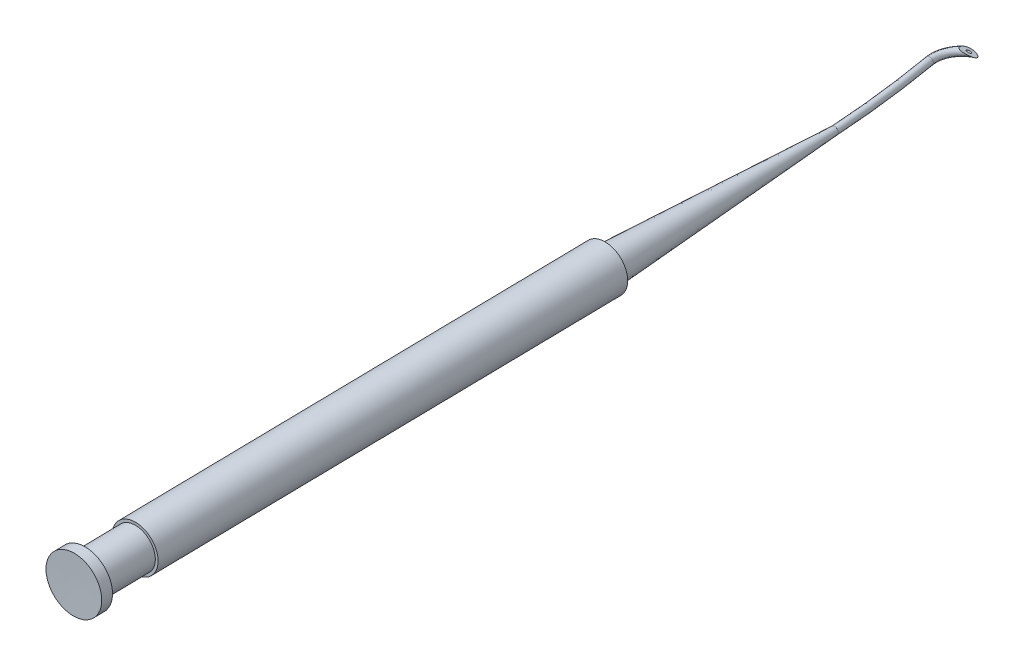
ISO-10303-21;
HEADER;
FILE_DESCRIPTION(('STEP AP214'),'2;1');
FILE_NAME('part.step','',(''),(''),'','','');
FILE_SCHEMA(('AUTOMOTIVE_DESIGN { 1 0 10303 214 1 1 1 1 }'));
ENDSEC;
DATA;
#1=APPLICATION_CONTEXT('core data for automotive mechanical design processes');
#2=APPLICATION_PROTOCOL_DEFINITION('international standard','automotive_design',2000,#1);
#3=PRODUCT_CONTEXT('',#1,'mechanical');
#4=PRODUCT('Part','Part','',(#3));
#5=PRODUCT_RELATED_PRODUCT_CATEGORY('part','',(#4));
#6=PRODUCT_DEFINITION_FORMATION('','',#4);
#7=PRODUCT_DEFINITION_CONTEXT('part definition',#1,'design');
#8=PRODUCT_DEFINITION('design','',#6,#7);
#9=PRODUCT_DEFINITION_SHAPE('','',#8);
#10=(LENGTH_UNIT() NAMED_UNIT(*) SI_UNIT(.MILLI.,.METRE.));
#11=(NAMED_UNIT(*) PLANE_ANGLE_UNIT() SI_UNIT($,.RADIAN.));
#12=(NAMED_UNIT(*) SI_UNIT($,.STERADIAN.) SOLID_ANGLE_UNIT());
#13=UNCERTAINTY_MEASURE_WITH_UNIT(LENGTH_MEASURE(1.E-05),#10,'distance_accuracy_value','');
#14=(GEOMETRIC_REPRESENTATION_CONTEXT(3) GLOBAL_UNCERTAINTY_ASSIGNED_CONTEXT((#13)) GLOBAL_UNIT_ASSIGNED_CONTEXT((#10,
#11,#12)) REPRESENTATION_CONTEXT('',''));
#15=CARTESIAN_POINT('',(0.,0.,0.));
#16=DIRECTION('',(0.,0.,1.));
#17=DIRECTION('',(1.,0.,0.));
#18=AXIS2_PLACEMENT_3D('',#15,#16,#17);
#19=CARTESIAN_POINT('',(22.5831114339788,9.8277538825437E-11,-64.5016753142618));
#20=DIRECTION('',(-0.109478747496273,1.17499877810958E-08,-0.993989136684424));
#21=DIRECTION('',(6.96705910834885E-07,-0.999999999999753,-8.8556780978676E-08));
#22=AXIS2_PLACEMENT_3D('',#19,#20,#21);
#23=ELLIPSE('',#22,0.499930018106646,0.499860046008388);
#24=CARTESIAN_POINT('',(26.3470233288516,0.,-65.1616041607414));
#25=DIRECTION('',(0.,-1.,0.));
#26=AXIS1_PLACEMENT('',#24,#25);
#27=SURFACE_OF_REVOLUTION('',#23,#26);
#28=CARTESIAN_POINT('',(22.583111782283,-0.499930018008245,-64.501675358534));
#29=VERTEX_POINT('',#28);
#30=EDGE_CURVE('E11',#29,#29,#23,.T.);
#31=ORIENTED_EDGE('',*,*,#30,.T.);
#32=EDGE_LOOP('',(#31));
#33=FACE_BOUND('',#32,.T.);
#34=CARTESIAN_POINT('',(24.9673108094636,-0.499930018008369,-68.7251602751983));
#35=CARTESIAN_POINT('',(24.9720421356718,-0.499929058933173,-68.7101541085953));
#36=CARTESIAN_POINT('',(24.9755382117221,-0.499178861833237,-68.6947500829478));
#37=CARTESIAN_POINT('',(24.9801083631665,-0.496304689823547,-68.6637105748331));
#38=CARTESIAN_POINT('',(24.9811781378118,-0.494178284069482,-68.648074730739));
#39=CARTESIAN_POINT('',(24.9811775565817,-0.487976825887834,-68.6123677460165));
#40=CARTESIAN_POINT('',(24.979371586523,-0.483509212339946,-68.5923684466193));
#41=CARTESIAN_POINT('',(24.9729573274267,-0.47317707784225,-68.5532110048963));
#42=CARTESIAN_POINT('',(24.9683428938416,-0.467309511141893,-68.5340548059848));
#43=CARTESIAN_POINT('',(24.9527370762559,-0.449759678943743,-68.4824786797887));
#44=CARTESIAN_POINT('',(24.9395659872748,-0.437054476377037,-68.4510792865732));
#45=CARTESIAN_POINT('',(24.9169683938769,-0.416793959256663,-68.4060620605774));
#46=CARTESIAN_POINT('',(24.908948332602,-0.409828755652951,-68.391383045386));
#47=CARTESIAN_POINT('',(24.8921373429159,-0.395579636637972,-68.3626338597731));
#48=CARTESIAN_POINT('',(24.8833467399078,-0.388295856407882,-68.3485634360543));
#49=CARTESIAN_POINT('',(24.8594780210866,-0.368864118607612,-68.3123485287508));
#50=CARTESIAN_POINT('',(24.8438992289896,-0.356516936989338,-68.2906442778381));
#51=CARTESIAN_POINT('',(24.8115715944131,-0.331378452674664,-68.2483881057122));
#52=CARTESIAN_POINT('',(24.79482210663,-0.318586907023909,-68.2278368314665));
#53=CARTESIAN_POINT('',(24.7432050600739,-0.279690248082909,-68.167516221787));
#54=CARTESIAN_POINT('',(24.7070330478813,-0.253114260054299,-68.1291712889917));
#55=CARTESIAN_POINT('',(24.6321559442022,-0.19896430019462,-68.0547660130705));
#56=CARTESIAN_POINT('',(24.5934269780054,-0.171382474914987,-68.0187361433747));
#57=CARTESIAN_POINT('',(24.5144891432225,-0.115788594994703,-67.9488911081614));
#58=CARTESIAN_POINT('',(24.4742832431525,-0.087777462915919,-67.9150718432141));
#59=CARTESIAN_POINT('',(24.4018109183686,-0.03775012455854,-67.8567808360732));
#60=CARTESIAN_POINT('',(24.3698018994937,-0.015808570104881,-67.8319228452753));
#61=CARTESIAN_POINT('',(24.3049854833423,0.0283096013773949,-67.7833845962622));
#62=CARTESIAN_POINT('',(24.2721772245207,0.0504864560733446,-67.7597057010503));
#63=CARTESIAN_POINT('',(24.2056041432552,0.0951370327169918,-67.7136712889801));
#64=CARTESIAN_POINT('',(24.1718362679552,0.117611542494125,-67.691320914758));
#65=CARTESIAN_POINT('',(24.103778481301,0.162471449392926,-67.648788401412));
#66=CARTESIAN_POINT('',(24.0695030146014,0.184853497321713,-67.6285797506906));
#67=CARTESIAN_POINT('',(23.9997663139606,0.229811541501921,-67.5908051374253));
#68=CARTESIAN_POINT('',(23.9643088240715,0.252386783076262,-67.573231649916));
#69=CARTESIAN_POINT('',(23.9099424776994,0.286344391971215,-67.5500673926536));
#70=CARTESIAN_POINT('',(23.8916675762637,0.297652953854774,-67.5428916534562));
#71=CARTESIAN_POINT('',(23.8546433139361,0.320287365610427,-67.5299448996422));
#72=CARTESIAN_POINT('',(23.8358943318812,0.331613195281426,-67.5241728002459));
#73=CARTESIAN_POINT('',(23.8059841389506,0.349396757584842,-67.5166027693344));
#74=CARTESIAN_POINT('',(23.7949980968325,0.355870042945422,-67.5141599115282));
#75=CARTESIAN_POINT('',(23.7728559517719,0.368775923917861,-67.5100476698668));
#76=CARTESIAN_POINT('',(23.7616997499441,0.375208492536957,-67.5083787549547));
#77=CARTESIAN_POINT('',(23.7280901083724,0.394336329673653,-67.5047972912357));
#78=CARTESIAN_POINT('',(23.7053688374178,0.406937764376009,-67.5042742075185));
#79=CARTESIAN_POINT('',(23.6704250458202,0.42556499989383,-67.5078051904579));
#80=CARTESIAN_POINT('',(23.6581941163931,0.431942762638672,-67.5098592731496));
#81=CARTESIAN_POINT('',(23.6339693079145,0.444221354918804,-67.5159621169534));
#82=CARTESIAN_POINT('',(23.6219753854816,0.450122272357661,-67.5200105094456));
#83=CARTESIAN_POINT('',(23.598483430556,0.461247830923102,-67.5304291677208));
#84=CARTESIAN_POINT('',(23.5869925741765,0.466464033320806,-67.5368252730078));
#85=CARTESIAN_POINT('',(23.5651785386916,0.475849619085867,-67.5519430934095));
#86=CARTESIAN_POINT('',(23.5548539222141,0.480020298951163,-67.5606619002963));
#87=CARTESIAN_POINT('',(23.5370159327849,0.486688134124953,-67.5788228604278));
#88=CARTESIAN_POINT('',(23.5293117251955,0.489331754310842,-67.588026689461));
#89=CARTESIAN_POINT('',(23.5152029133864,0.493702286511455,-67.6075924906154));
#90=CARTESIAN_POINT('',(23.5088009130996,0.495427372721135,-67.6179567202115));
#91=CARTESIAN_POINT('',(23.4950351838797,0.498536247778954,-67.6436995708269));
#92=CARTESIAN_POINT('',(23.4882802054851,0.499520333423639,-67.6594496961861));
#93=CARTESIAN_POINT('',(23.4769867430842,0.500131626743661,-67.6917356486855));
#94=CARTESIAN_POINT('',(23.4724521952911,0.499756434607352,-67.7082728145204));
#95=CARTESIAN_POINT('',(23.4630106896442,0.497370075841125,-67.7519480307062));
#96=CARTESIAN_POINT('',(23.4595888035735,0.494494912077075,-67.7793526803273));
#97=CARTESIAN_POINT('',(23.456330643713,0.486784367774212,-67.8340810062063));
#98=CARTESIAN_POINT('',(23.4565031253839,0.481944228882849,-67.8614043225552));
#99=CARTESIAN_POINT('',(23.4594595066627,0.471449975504619,-67.9124584494178));
#100=CARTESIAN_POINT('',(23.4619412810589,0.465953138313597,-67.9362415225265));
#101=CARTESIAN_POINT('',(23.4687248669264,0.454042631836058,-67.9833164931609));
#102=CARTESIAN_POINT('',(23.4730277051037,0.447628446706414,-68.0066081058146));
#103=CARTESIAN_POINT('',(23.4882713695871,0.427238970753754,-68.07568348585));
#104=CARTESIAN_POINT('',(23.5015433823958,0.412127348515873,-68.1206193876615));
#105=CARTESIAN_POINT('',(23.5418418482133,0.370474092324221,-68.2326983527622));
#106=CARTESIAN_POINT('',(23.5723987509448,0.342316460891245,-68.297953274434));
#107=CARTESIAN_POINT('',(23.6426675918066,0.282199818960663,-68.4213259778523));
#108=CARTESIAN_POINT('',(23.682386793356,0.250237802315453,-68.4794380407686));
#109=CARTESIAN_POINT('',(23.7707703337744,0.182479261972659,-68.5893812627937));
#110=CARTESIAN_POINT('',(23.8196667276652,0.146596630210414,-68.6409725144915));
#111=CARTESIAN_POINT('',(23.9243806780266,0.0726563410683381,-68.7347355984774));
#112=CARTESIAN_POINT('',(23.9801982931227,0.0345986652664677,-68.7769073509701));
#113=CARTESIAN_POINT('',(24.093430821249,-0.0400501974714149,-68.8477423920347));
#114=CARTESIAN_POINT('',(24.1504322851152,-0.0765458828312148,-68.8771666080646));
#115=CARTESIAN_POINT('',(24.2686310250647,-0.149951432345283,-68.9250971372324));
#116=CARTESIAN_POINT('',(24.3298213609892,-0.186860530559034,-68.9436210437179));
#117=CARTESIAN_POINT('',(24.430816669347,-0.245766715530506,-68.9626056749157));
#118=CARTESIAN_POINT('',(24.4697080781291,-0.267993615704675,-68.9672861446949));
#119=CARTESIAN_POINT('',(24.5481612471359,-0.311771278532603,-68.9706284481567));
#120=CARTESIAN_POINT('',(24.5877221092034,-0.333322851184135,-68.9692977935178));
#121=CARTESIAN_POINT('',(24.6539969890065,-0.368333622448873,-68.9607703601317));
#122=CARTESIAN_POINT('',(24.6807668504458,-0.382173618855509,-68.9555892139644));
#123=CARTESIAN_POINT('',(24.7337158232533,-0.408804130081483,-68.9410568358692));
#124=CARTESIAN_POINT('',(24.7598958300587,-0.421596326046366,-68.9317124452241));
#125=CARTESIAN_POINT('',(24.8022288490286,-0.441465941086994,-68.911907744751));
#126=CARTESIAN_POINT('',(24.818812255231,-0.449025775566947,-68.9028606855217));
#127=CARTESIAN_POINT('',(24.8508103945949,-0.463054487049982,-68.8821899592168));
#128=CARTESIAN_POINT('',(24.8662267319766,-0.469524877130641,-68.8705699184726));
#129=CARTESIAN_POINT('',(24.8919432268904,-0.479666241262545,-68.8474312447339));
#130=CARTESIAN_POINT('',(24.902618399731,-0.483639754659271,-68.8364656898409));
#131=CARTESIAN_POINT('',(24.9223649793152,-0.490412746454514,-68.8128590608813));
#132=CARTESIAN_POINT('',(24.9314392771938,-0.493214354096775,-68.8002210809584));
#133=CARTESIAN_POINT('',(24.9452759542531,-0.496839088431221,-68.7772236774675));
#134=CARTESIAN_POINT('',(24.9505348556498,-0.497996214297515,-68.76721324492));
#135=CARTESIAN_POINT('',(24.9598466770194,-0.499541971369733,-68.7465908421269));
#136=CARTESIAN_POINT('',(24.9638997646453,-0.499930709452656,-68.7359789557504));
#137=CARTESIAN_POINT('',(24.9673108094636,-0.499930018008369,-68.7251602751983));
#138=B_SPLINE_CURVE_WITH_KNOTS('',3,(#34,#35,#36,#37,#38,#39,#40,#41,#42,#43,#44,#45,#46,#47,
#48,#49,#50,#51,#52,#53,#54,#55,#56,#57,#58,#59,#60,#61,#62,#63,#64,#65,#66,#67,#68,#69,#70,#71,
#72,#73,#74,#75,#76,#77,#78,#79,#80,#81,#82,#83,#84,#85,#86,#87,#88,#89,#90,#91,#92,#93,#94,#95,
#96,#97,#98,#99,#100,#101,#102,#103,#104,#105,#106,#107,#108,#109,#110,#111,#112,#113,#114,#115,
#116,#117,#118,#119,#120,#121,#122,#123,#124,#125,#126,#127,#128,#129,#130,#131,#132,#133,#134,
#135,#136,#137),.UNSPECIFIED.,.T.,.F.,(4,2,2,2,2,2,2,2,2,2,2,2,2,2,2,2,2,2,2,2,2,2,2,2,2,2,2,2,
2,2,2,2,2,2,2,2,2,2,2,2,2,2,2,2,2,2,2,2,2,2,2,4),(0.,0.0471545466782314,0.0943926122010786,
0.155756154754986,0.217254437684398,0.325632021897614,0.37998253409831,0.434310203417291,
0.522536967936939,0.610812753737915,0.787730729944808,0.966634465630598,1.14519642753107,
1.28343532692558,1.42183048382554,1.56073049104702,1.69763729509669,1.83414538198455,
1.90208387262948,1.96996969006788,2.00889517199391,2.04784420871571,2.12528858893188,
2.16701060953617,2.20872492130745,2.25091283579317,2.29304817354114,2.32974914607126,
2.36652280073022,2.41772976080071,2.46902717103435,2.55186287449133,2.63490037959665,
2.70840325935077,2.78194763495387,2.92918387734521,3.16007280896058,3.39114541083271,
3.62913076907646,3.86711814329118,4.0877472329388,4.30801923848836,4.44283206376678,
4.57747646959518,4.66899029643203,4.76035429397478,4.82122618283831,4.88201281951232,
4.92926991361877,4.97644076906489,5.01044152112282,5.04443754359735),.UNSPECIFIED.);
#139=CARTESIAN_POINT('',(24.9673108094636,-0.499930018008369,-68.7251602751983));
#140=VERTEX_POINT('',#139);
#141=EDGE_CURVE('E78',#140,#140,#138,.T.);
#142=ORIENTED_EDGE('',*,*,#141,.T.);
#143=EDGE_LOOP('',(#142));
#144=FACE_BOUND('',#143,.T.);
#145=ADVANCED_FACE('F41',(#33,#144),#27,.F.);
#146=CARTESIAN_POINT('',(22.5831114339788,9.8277538825437E-11,-64.5016753142618));
#147=DIRECTION('',(-0.109478747496273,1.17499877810958E-08,-0.993989136684424));
#148=DIRECTION('',(1.28637394537087E-09,1.,1.16793602105839E-08));
#149=AXIS2_PLACEMENT_3D('',#146,#147,#148);
#150=CIRCLE('',#149,0.150000000000002);
#151=CARTESIAN_POINT('',(26.3470233288516,0.,-65.1616041607414));
#152=DIRECTION('',(0.,-1.,0.));
#153=AXIS1_PLACEMENT('',#151,#152);
#154=SURFACE_OF_REVOLUTION('',#150,#153);
#155=CARTESIAN_POINT('',(22.5831114341717,0.150000000098279,-64.5016753125099));
#156=VERTEX_POINT('',#155);
#157=EDGE_CURVE('E49',#156,#156,#150,.T.);
#158=ORIENTED_EDGE('',*,*,#157,.F.);
#159=EDGE_LOOP('',(#158));
#160=FACE_BOUND('',#159,.T.);
#161=CARTESIAN_POINT('',(23.9677559788011,0.150000000098279,-68.1518592857474));
#162=CARTESIAN_POINT('',(23.9639273975209,0.150002837497812,-68.1639814438349));
#163=CARTESIAN_POINT('',(23.9624575910595,0.148584441863723,-68.1768087694563));
#164=CARTESIAN_POINT('',(23.9625227389016,0.144686614633218,-68.1990464302687));
#165=CARTESIAN_POINT('',(23.9634474304546,0.142523992830058,-68.2085673669476));
#166=CARTESIAN_POINT('',(23.9665299713709,0.137580263289465,-68.2272608450635));
#167=CARTESIAN_POINT('',(23.9686896670904,0.13479823333563,-68.2364328428838));
#168=CARTESIAN_POINT('',(23.9761688208598,0.12622181082318,-68.2621044168507));
#169=CARTESIAN_POINT('',(23.9826062284005,0.119901137559977,-68.2780899350358));
#170=CARTESIAN_POINT('',(23.9975012839376,0.10638742383872,-68.3086790172299));
#171=CARTESIAN_POINT('',(24.0059641575675,0.099192150971373,-68.3232788679087));
#172=CARTESIAN_POINT('',(24.0304152456348,0.0793055030693924,-68.3602668100171));
#173=CARTESIAN_POINT('',(24.0477091968911,0.0660929321835252,-68.3815161855115));
#174=CARTESIAN_POINT('',(24.085276036785,0.0386484670604313,-68.4204396321624));
#175=CARTESIAN_POINT('',(24.1055544599111,0.0244147047878051,-68.4381069126513));
#176=CARTESIAN_POINT('',(24.1456226293126,-0.00271231258361182,-68.4672720009374));
#177=CARTESIAN_POINT('',(24.1650944221378,-0.0155198907822468,-68.4792845393501));
#178=CARTESIAN_POINT('',(24.2056049390071,-0.0413638452977673,-68.4996591194674));
#179=CARTESIAN_POINT('',(24.2266353814411,-0.054398765500981,-68.5080390334744));
#180=CARTESIAN_POINT('',(24.2660851952605,-0.0779843680415044,-68.518772673465));
#181=CARTESIAN_POINT('',(24.2842487380364,-0.0885398233722469,-68.5219649862059));
#182=CARTESIAN_POINT('',(24.3120263160735,-0.104016740496395,-68.5230144889418));
#183=CARTESIAN_POINT('',(24.321436717548,-0.10914827378362,-68.5227269185761));
#184=CARTESIAN_POINT('',(24.3401959998926,-0.119080049685986,-68.5204392124885));
#185=CARTESIAN_POINT('',(24.3495449636702,-0.123881718415236,-68.5184470256652));
#186=CARTESIAN_POINT('',(24.3675421043615,-0.132701758923982,-68.5121741641384));
#187=CARTESIAN_POINT('',(24.3762032132129,-0.136740679157066,-68.507970809547));
#188=CARTESIAN_POINT('',(24.3881704649371,-0.141857060468436,-68.4994895122036));
#189=CARTESIAN_POINT('',(24.3920132494111,-0.143413415472985,-68.4962676855845));
#190=CARTESIAN_POINT('',(24.3991197835498,-0.146078915263201,-68.4890847626845));
#191=CARTESIAN_POINT('',(24.4023847232054,-0.147188985253444,-68.4851252209961));
#192=CARTESIAN_POINT('',(24.4077651558576,-0.148764601090065,-68.4771391956085));
#193=CARTESIAN_POINT('',(24.4099750834096,-0.149295393783883,-68.4731890077564));
#194=CARTESIAN_POINT('',(24.4137454159728,-0.149941511572287,-68.4649556216211));
#195=CARTESIAN_POINT('',(24.4153049185048,-0.150056261083754,-68.4606719703585));
#196=CARTESIAN_POINT('',(24.4193128472157,-0.14979297822182,-68.4464488360746));
#197=CARTESIAN_POINT('',(24.4204293037582,-0.14861801546856,-68.4361435236173));
#198=CARTESIAN_POINT('',(24.4202494028094,-0.145420071796267,-68.418299710255));
#199=CARTESIAN_POINT('',(24.4194545239461,-0.143658396075249,-68.4106759044335));
#200=CARTESIAN_POINT('',(24.4168562706402,-0.139631270463462,-68.3957249233635));
#201=CARTESIAN_POINT('',(24.4150505918321,-0.137364676622553,-68.3883984670751));
#202=CARTESIAN_POINT('',(24.4087517855242,-0.130292288199728,-68.3676450377765));
#203=CARTESIAN_POINT('',(24.4033033952533,-0.125039450983471,-68.3546725887942));
#204=CARTESIAN_POINT('',(24.3908504653701,-0.113868937512667,-68.3298332215861));
#205=CARTESIAN_POINT('',(24.3838424728155,-0.107949800675793,-68.3179688406657));
#206=CARTESIAN_POINT('',(24.3682589068288,-0.0952779351413655,-68.2944101518316));
#207=CARTESIAN_POINT('',(24.3596096390226,-0.0884959189510075,-68.2827808502223));
#208=CARTESIAN_POINT('',(24.3414275015041,-0.0746052806670512,-68.2604430614896));
#209=CARTESIAN_POINT('',(24.331893857525,-0.067496375182023,-68.2497353973691));
#210=CARTESIAN_POINT('',(24.3021458546051,-0.0457348535380176,-68.2187455207825));
#211=CARTESIAN_POINT('',(24.2808705568561,-0.0307159275683393,-68.1997177480684));
#212=CARTESIAN_POINT('',(24.2459956971297,-0.00680842564334451,-68.1726257010966));
#213=CARTESIAN_POINT('',(24.233121697362,0.00188010879600878,-68.163412901647));
#214=CARTESIAN_POINT('',(24.2067111645085,0.0194167416184159,-68.1461690704663));
#215=CARTESIAN_POINT('',(24.1931751030369,0.0282647236625993,-68.1381372133801));
#216=CARTESIAN_POINT('',(24.1655410773878,0.0460100489947714,-68.1235707800367));
#217=CARTESIAN_POINT('',(24.1514488817811,0.0549063298070863,-68.1170240324344));
#218=CARTESIAN_POINT('',(24.1225480100422,0.0727631286726211,-68.1058322482054));
#219=CARTESIAN_POINT('',(24.1077403859027,0.0817235368394583,-68.1011845089819));
#220=CARTESIAN_POINT('',(24.0845537533051,0.0953272188487253,-68.0963657774931));
#221=CARTESIAN_POINT('',(24.07643451058,0.1000145933812,-68.095117261688));
#222=CARTESIAN_POINT('',(24.0600489464841,0.10927015245601,-68.0937728540649));
#223=CARTESIAN_POINT('',(24.051782918707,0.113838537828713,-68.0936748750013));
#224=CARTESIAN_POINT('',(24.0331550111627,0.123818024416366,-68.0952713334737));
#225=CARTESIAN_POINT('',(24.0227718448733,0.129164215220755,-68.0974070226587));
#226=CARTESIAN_POINT('',(24.005278067378,0.137530421759587,-68.1046972107335));
#227=CARTESIAN_POINT('',(23.9979786323146,0.14080098366921,-68.1090076961789));
#228=CARTESIAN_POINT('',(23.9882482408229,0.144697487024254,-68.1174212610652));
#229=CARTESIAN_POINT('',(23.9851943442821,0.145831544852276,-68.1205735665156));
#230=CARTESIAN_POINT('',(23.9796403184838,0.147698187663,-68.127434195704));
#231=CARTESIAN_POINT('',(23.9771399669402,0.148430933974605,-68.1311422952458));
#232=CARTESIAN_POINT('',(23.9719882953514,0.149667969393465,-68.1403526263526));
#233=CARTESIAN_POINT('',(23.9695988734816,0.149998634310766,-68.1460242625311));
#234=CARTESIAN_POINT('',(23.9677559788011,0.150000000098279,-68.1518592857474));
#235=B_SPLINE_CURVE_WITH_KNOTS('',3,(#161,#162,#163,#164,#165,#166,#167,#168,#169,#170,#171,
#172,#173,#174,#175,#176,#177,#178,#179,#180,#181,#182,#183,#184,#185,#186,#187,#188,#189,#190,
#191,#192,#193,#194,#195,#196,#197,#198,#199,#200,#201,#202,#203,#204,#205,#206,#207,#208,#209,
#210,#211,#212,#213,#214,#215,#216,#217,#218,#219,#220,#221,#222,#223,#224,#225,#226,#227,#228,
#229,#230,#231,#232,#233,#234),.UNSPECIFIED.,.T.,.F.,(4,2,2,2,2,2,2,2,2,2,2,2,2,2,2,2,2,2,2,2,2,
2,2,2,2,2,2,2,2,2,2,2,2,2,2,2,4),(0.,0.0380433004130549,0.0673869092019118,0.0967745024013843,
0.151546856790176,0.206462074884913,0.297231717375583,0.388171857581948,0.466576356935355,
0.544590607398622,0.607888077968787,0.639953474096885,0.671870154013364,0.702738457120395,
0.71840535475871,0.734039603370961,0.747631765670981,0.761242725155169,0.791896300752409,
0.81540914377172,0.838975809652551,0.883787534236798,0.928699476341046,0.976629494654413,
1.02460187878631,1.12103371367537,1.17517570942136,1.22927968385747,1.28292278994626,
1.33648928503334,1.36480670264985,1.39307274028225,1.42820602483076,1.45493788678438,
1.4684555093055,1.48196769368983,1.50027990670759),.UNSPECIFIED.);
#236=CARTESIAN_POINT('',(23.9677559788011,0.150000000098279,-68.1518592857474));
#237=VERTEX_POINT('',#236);
#238=EDGE_CURVE('E72',#237,#237,#235,.T.);
#239=ORIENTED_EDGE('',*,*,#238,.F.);
#240=EDGE_LOOP('',(#239));
#241=FACE_BOUND('',#240,.T.);
#242=ADVANCED_FACE('F66',(#160,#241),#154,.T.);
#243=CARTESIAN_POINT('',(-110.498865130992,0.,-41.1686652008343));
#244=DIRECTION('',(0.,-1.,0.));
#245=AXIS1_PLACEMENT('',#243,#244);
#246=SURFACE_OF_REVOLUTION('',#150,#245);
#247=ORIENTED_EDGE('',*,*,#157,.T.);
#248=EDGE_LOOP('',(#247));
#249=FACE_BOUND('',#248,.T.);
#250=CARTESIAN_POINT('',(24.337642585616,9.8277538825437E-11,-49.7917756710677));
#251=DIRECTION('',(0.,1.17499877810958E-08,-1.));
#252=DIRECTION('',(0.,1.,1.17499877810958E-08));
#253=AXIS2_PLACEMENT_3D('',#250,#251,#252);
#254=CIRCLE('',#253,0.150000000000002);
#255=CARTESIAN_POINT('',(24.337642585616,0.150000000098279,-49.7917756693052));
#256=VERTEX_POINT('',#255);
#257=EDGE_CURVE('E57',#256,#256,#254,.T.);
#258=ORIENTED_EDGE('',*,*,#257,.F.);
#259=EDGE_LOOP('',(#258));
#260=FACE_BOUND('',#259,.T.);
#261=ADVANCED_FACE('F63',(#249,#260),#246,.F.);
#262=CARTESIAN_POINT('',(-110.498865130992,0.,-41.1686652008343));
#263=DIRECTION('',(0.,-1.,0.));
#264=AXIS1_PLACEMENT('',#262,#263);
#265=SURFACE_OF_REVOLUTION('',#23,#264);
#266=ORIENTED_EDGE('',*,*,#30,.F.);
#267=EDGE_LOOP('',(#266));
#268=FACE_BOUND('',#267,.T.);
#269=CARTESIAN_POINT('',(24.337642585616,9.8277538825437E-11,-49.7917756710677));
#270=DIRECTION('',(0.,1.17499877810958E-08,-1.));
#271=DIRECTION('',(7.0221319229755E-07,-0.999999999999753,-1.17499877810929E-08));
#272=AXIS2_PLACEMENT_3D('',#269,#270,#271);
#273=ELLIPSE('',#272,0.499930018106646,0.499860046008388);
#274=CARTESIAN_POINT('',(24.3376429366734,-0.499930018008245,-49.7917756769419));
#275=VERTEX_POINT('',#274);
#276=EDGE_CURVE('E53',#275,#275,#273,.T.);
#277=ORIENTED_EDGE('',*,*,#276,.T.);
#278=EDGE_LOOP('',(#277));
#279=FACE_BOUND('',#278,.T.);
#280=ADVANCED_FACE('F70',(#268,#279),#265,.T.);
#281=CARTESIAN_POINT('',(24.337642585616,9.8277538825437E-11,-49.7917756710677));
#282=DIRECTION('',(0.,1.17499877810958E-08,-1.));
#283=DIRECTION('',(0.,1.,1.17499877810958E-08));
#284=AXIS2_PLACEMENT_3D('',#281,#282,#283);
#285=PLANE('',#284);
#286=ORIENTED_EDGE('',*,*,#257,.T.);
#287=EDGE_LOOP('',(#286));
#288=FACE_BOUND('',#287,.T.);
#289=ORIENTED_EDGE('',*,*,#276,.F.);
#290=EDGE_LOOP('',(#289));
#291=FACE_BOUND('',#290,.T.);
#292=ADVANCED_FACE('F84',(#288,#291),#285,.F.);
#293=CARTESIAN_POINT('',(10.3994021609079,18.8870064530202,-3.28005674968843));
#294=DIRECTION('',(0.47684351026824,0.866025403784442,-0.150400354770386));
#295=DIRECTION('',(-0.875989634061789,0.482329929629391,0.));
#296=AXIS2_PLACEMENT_3D('',#293,#294,#295);
#297=PLANE('',#296);
#298=ORIENTED_EDGE('',*,*,#141,.F.);
#299=EDGE_LOOP('',(#298));
#300=FACE_BOUND('',#299,.T.);
#301=ORIENTED_EDGE('',*,*,#238,.T.);
#302=EDGE_LOOP('',(#301));
#303=FACE_BOUND('',#302,.T.);
#304=ADVANCED_FACE('F81',(#300,#303),#297,.T.);
#305=CLOSED_SHELL('',(#145,#242,#261,#280,#292,#304));
#306=MANIFOLD_SOLID_BREP('B2',#305);
#307=CARTESIAN_POINT('',(24.337642585616,0.,-49.7834116165124));
#308=DIRECTION('',(0.0167304507679107,0.,0.999860036213621));
#309=DIRECTION('',(0.999860036213621,0.,-0.0167304507679107));
#310=AXIS2_PLACEMENT_3D('',#307,#308,#309);
#311=CONICAL_SURFACE('',#310,0.499930018106645,1.55406509543088);
#312=CARTESIAN_POINT('',(24.3375026316244,0.,-49.7917756710677));
#313=VERTEX_POINT('',#312);
#314=VERTEX_LOOP('',#313);
#315=FACE_BOUND('',#314,.T.);
#316=CARTESIAN_POINT('',(24.337642585616,0.,-49.7834116165124));
#317=DIRECTION('',(-0.0167304507679107,0.,-0.999860036213621));
#318=DIRECTION('',(-0.999860036213621,0.,0.0167304507679107));
#319=AXIS2_PLACEMENT_3D('',#316,#317,#318);
#320=CIRCLE('',#319,0.499930018106646);
#321=CARTESIAN_POINT('',(23.8377825396076,0.,-49.7750475619571));
#322=VERTEX_POINT('',#321);
#323=EDGE_CURVE('E39',#322,#322,#320,.T.);
#324=ORIENTED_EDGE('',*,*,#323,.T.);
#325=EDGE_LOOP('',(#324));
#326=FACE_BOUND('',#325,.T.);
#327=ADVANCED_FACE('F145',(#315,#326),#311,.T.);
#328=CARTESIAN_POINT('',(24.8726600990155,0.,-17.809220499765));
#329=DIRECTION('',(0.0167304507679107,0.,0.999860036213621));
#330=DIRECTION('',(0.999860036213621,0.,-0.0167304507679107));
#331=AXIS2_PLACEMENT_3D('',#328,#329,#330);
#332=CONICAL_SURFACE('',#331,2.29127121935524,0.0559582753425584);
#333=ORIENTED_EDGE('',*,*,#323,.F.);
#334=EDGE_LOOP('',(#333));
#335=FACE_BOUND('',#334,.T.);
#336=CARTESIAN_POINT('',(24.8726600990155,0.,-17.809220499765));
#337=DIRECTION('',(-0.0167304507679107,0.,-0.999860036213621));
#338=DIRECTION('',(-0.999860036213621,0.,0.0167304507679107));
#339=AXIS2_PLACEMENT_3D('',#336,#337,#338);
#340=CIRCLE('',#339,2.29127121935524);
#341=CARTESIAN_POINT('',(22.5817095746557,0.,-17.7708864994337));
#342=VERTEX_POINT('',#341);
#343=EDGE_CURVE('E152',#342,#342,#340,.T.);
#344=ORIENTED_EDGE('',*,*,#343,.T.);
#345=EDGE_LOOP('',(#344));
#346=FACE_BOUND('',#345,.T.);
#347=ADVANCED_FACE('F171',(#335,#346),#332,.T.);
#348=CARTESIAN_POINT('',(24.8728865003451,0.,-17.7956901027158));
#349=DIRECTION('',(0.0167304507679107,0.,0.999860036213621));
#350=DIRECTION('',(0.999860036213621,0.,-0.0167304507679107));
#351=AXIS2_PLACEMENT_3D('',#348,#349,#350);
#352=CONICAL_SURFACE('',#351,3.1,1.55406509543087);
#353=ORIENTED_EDGE('',*,*,#343,.F.);
#354=EDGE_LOOP('',(#353));
#355=FACE_BOUND('',#354,.T.);
#356=CARTESIAN_POINT('',(24.8728865003451,0.,-17.7956901027158));
#357=DIRECTION('',(-0.0167304507679107,0.,-0.999860036213621));
#358=DIRECTION('',(-0.999860036213621,0.,0.0167304507679107));
#359=AXIS2_PLACEMENT_3D('',#356,#357,#358);
#360=CIRCLE('',#359,3.1);
#361=CARTESIAN_POINT('',(21.7733203880829,0.,-17.7438257053353));
#362=VERTEX_POINT('',#361);
#363=EDGE_CURVE('E183',#362,#362,#360,.T.);
#364=ORIENTED_EDGE('',*,*,#363,.T.);
#365=EDGE_LOOP('',(#364));
#366=FACE_BOUND('',#365,.T.);
#367=ADVANCED_FACE('F175',(#355,#366),#352,.T.);
#368=CARTESIAN_POINT('',(24.8861041465377,0.,-17.0057654088692));
#369=DIRECTION('',(-0.0167304507679107,0.,-0.999860036213621));
#370=DIRECTION('',(-0.999860036213621,0.,0.0167304507679107));
#371=AXIS2_PLACEMENT_3D('',#368,#369,#370);
#372=CYLINDRICAL_SURFACE('',#371,3.1);
#373=ORIENTED_EDGE('',*,*,#363,.F.);
#374=EDGE_LOOP('',(#373));
#375=FACE_BOUND('',#374,.T.);
#376=CARTESIAN_POINT('',(25.9660800783786,0.,47.5367140078499));
#377=DIRECTION('',(-0.0167304507679107,0.,-0.999860036213621));
#378=DIRECTION('',(-0.999860036213621,0.,0.0167304507679107));
#379=AXIS2_PLACEMENT_3D('',#376,#377,#378);
#380=CIRCLE('',#379,3.1);
#381=CARTESIAN_POINT('',(22.8665139661164,0.,47.5885784052304));
#382=VERTEX_POINT('',#381);
#383=EDGE_CURVE('E185',#382,#382,#380,.T.);
#384=ORIENTED_EDGE('',*,*,#383,.T.);
#385=EDGE_LOOP('',(#384));
#386=FACE_BOUND('',#385,.T.);
#387=ADVANCED_FACE('F218',(#375,#386),#372,.T.);
#388=CARTESIAN_POINT('',(25.9659750981916,0.,47.5304400888119));
#389=DIRECTION('',(0.0167304507679107,0.,0.999860036213621));
#390=DIRECTION('',(0.999860036213621,0.,-0.0167304507679107));
#391=AXIS2_PLACEMENT_3D('',#388,#389,#390);
#392=CONICAL_SURFACE('',#391,2.725,1.55406509543086);
#393=ORIENTED_EDGE('',*,*,#383,.F.);
#394=EDGE_LOOP('',(#393));
#395=FACE_BOUND('',#394,.T.);
#396=CARTESIAN_POINT('',(25.9659750981916,0.,47.5304400888119));
#397=DIRECTION('',(-0.0167304507679107,0.,-0.999860036213621));
#398=DIRECTION('',(-0.999860036213621,0.,0.0167304507679107));
#399=AXIS2_PLACEMENT_3D('',#396,#397,#398);
#400=CIRCLE('',#399,2.725);
#401=CARTESIAN_POINT('',(23.2413564995095,0.,47.5760305671545));
#402=VERTEX_POINT('',#401);
#403=EDGE_CURVE('E190',#402,#402,#400,.T.);
#404=ORIENTED_EDGE('',*,*,#403,.T.);
#405=EDGE_LOOP('',(#404));
#406=FACE_BOUND('',#405,.T.);
#407=ADVANCED_FACE('F211',(#395,#406),#392,.F.);
#408=CARTESIAN_POINT('',(24.8861041465377,0.,-17.0057654088692));
#409=DIRECTION('',(-0.0167304507679107,0.,-0.999860036213621));
#410=DIRECTION('',(-0.999860036213621,0.,0.0167304507679107));
#411=AXIS2_PLACEMENT_3D('',#408,#409,#410);
#412=CYLINDRICAL_SURFACE('',#411,2.725);
#413=ORIENTED_EDGE('',*,*,#403,.F.);
#414=EDGE_LOOP('',(#413));
#415=FACE_BOUND('',#414,.T.);
#416=CARTESIAN_POINT('',(26.083088253567,0.,54.5294603423073));
#417=DIRECTION('',(-0.0167304507679107,0.,-0.999860036213621));
#418=DIRECTION('',(-0.999860036213621,0.,0.0167304507679107));
#419=AXIS2_PLACEMENT_3D('',#416,#417,#418);
#420=CIRCLE('',#419,2.725);
#421=CARTESIAN_POINT('',(23.3584696548849,0.,54.5750508206498));
#422=VERTEX_POINT('',#421);
#423=EDGE_CURVE('E193',#422,#422,#420,.T.);
#424=ORIENTED_EDGE('',*,*,#423,.T.);
#425=EDGE_LOOP('',(#424));
#426=FACE_BOUND('',#425,.T.);
#427=ADVANCED_FACE('F205',(#415,#426),#412,.T.);
#428=CARTESIAN_POINT('',(26.0833751994115,0.,54.5466090543444));
#429=DIRECTION('',(0.0167304507679107,0.,0.999860036213621));
#430=DIRECTION('',(0.999860036213621,0.,-0.0167304507679107));
#431=AXIS2_PLACEMENT_3D('',#428,#429,#430);
#432=CONICAL_SURFACE('',#431,3.75,1.55406509543086);
#433=ORIENTED_EDGE('',*,*,#423,.F.);
#434=EDGE_LOOP('',(#433));
#435=FACE_BOUND('',#434,.T.);
#436=CARTESIAN_POINT('',(26.0833751994115,0.,54.5466090543444));
#437=DIRECTION('',(-0.0167304507679107,0.,-0.999860036213621));
#438=DIRECTION('',(-0.999860036213621,0.,0.0167304507679107));
#439=AXIS2_PLACEMENT_3D('',#436,#437,#438);
#440=CIRCLE('',#439,3.75);
#441=CARTESIAN_POINT('',(22.3339000636104,0.,54.609348244724));
#442=VERTEX_POINT('',#441);
#443=EDGE_CURVE('E196',#442,#442,#440,.T.);
#444=ORIENTED_EDGE('',*,*,#443,.T.);
#445=EDGE_LOOP('',(#444));
#446=FACE_BOUND('',#445,.T.);
#447=ADVANCED_FACE('F166',(#435,#446),#432,.T.);
#448=CARTESIAN_POINT('',(24.8861041465377,0.,-17.0057654088692));
#449=DIRECTION('',(-0.0167304507679107,0.,-0.999860036213621));
#450=DIRECTION('',(-0.999860036213621,0.,0.0167304507679107));
#451=AXIS2_PLACEMENT_3D('',#448,#449,#450);
#452=CYLINDRICAL_SURFACE('',#451,3.75);
#453=ORIENTED_EDGE('',*,*,#443,.F.);
#454=EDGE_LOOP('',(#453));
#455=FACE_BOUND('',#454,.T.);
#456=CARTESIAN_POINT('',(26.1084708755634,0.,56.0463991086648));
#457=DIRECTION('',(-0.0167304507679107,0.,-0.999860036213621));
#458=DIRECTION('',(-0.999860036213621,0.,0.0167304507679107));
#459=AXIS2_PLACEMENT_3D('',#456,#457,#458);
#460=CIRCLE('',#459,3.75);
#461=CARTESIAN_POINT('',(22.3589957397623,0.,56.1091382990445));
#462=VERTEX_POINT('',#461);
#463=EDGE_CURVE('E199',#462,#462,#460,.T.);
#464=ORIENTED_EDGE('',*,*,#463,.T.);
#465=EDGE_LOOP('',(#464));
#466=FACE_BOUND('',#465,.T.);
#467=ADVANCED_FACE('F160',(#455,#466),#452,.T.);
#468=CARTESIAN_POINT('',(26.1074210736933,0.,55.9836599182852));
#469=DIRECTION('',(0.0167304507679107,0.,0.999860036213621));
#470=DIRECTION('',(0.999860036213621,0.,-0.0167304507679107));
#471=AXIS2_PLACEMENT_3D('',#468,#469,#470);
#472=CONICAL_SURFACE('',#471,0.,1.55406509543088);
#473=ORIENTED_EDGE('',*,*,#463,.F.);
#474=EDGE_LOOP('',(#473));
#475=FACE_BOUND('',#474,.T.);
#476=CARTESIAN_POINT('',(26.1074210736933,0.,55.9836599182852));
#477=VERTEX_POINT('',#476);
#478=VERTEX_LOOP('',#477);
#479=FACE_BOUND('',#478,.T.);
#480=ADVANCED_FACE('F158',(#475,#479),#472,.F.);
#481=CLOSED_SHELL('',(#327,#347,#367,#387,#407,#427,#447,#467,#480));
#482=MANIFOLD_SOLID_BREP('B6',#481);
#483=ADVANCED_BREP_SHAPE_REPRESENTATION('',(#18,#306,#482),#14);
#484=SHAPE_DEFINITION_REPRESENTATION(#9,#483);
ENDSEC;
END-ISO-10303-21;
